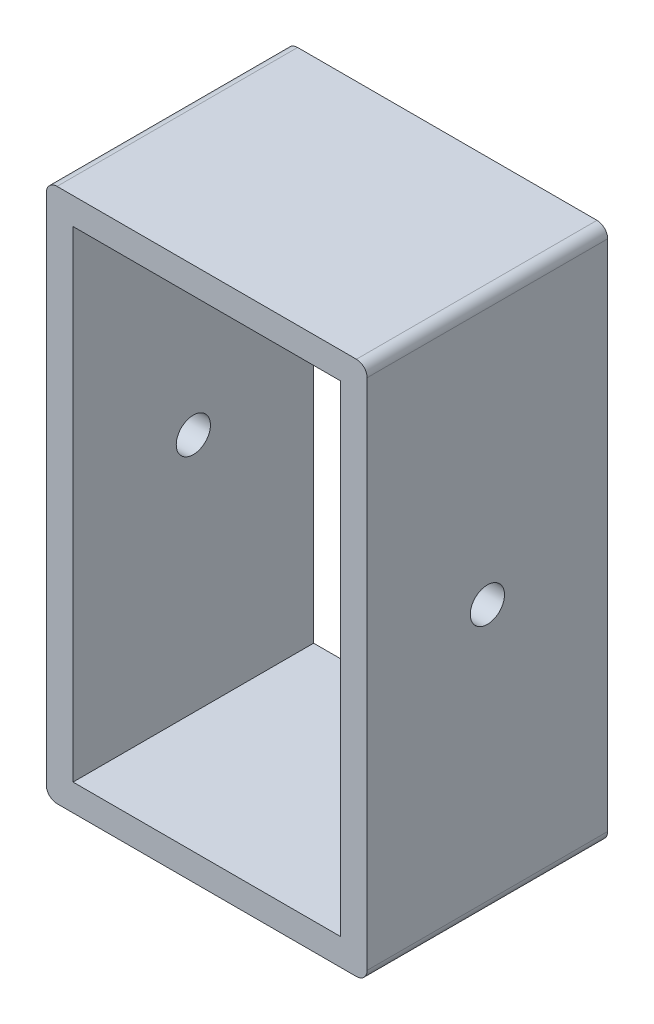
ISO-10303-21;
HEADER;
FILE_DESCRIPTION(('STEP AP214'),'2;1');
FILE_NAME('part.step','',(''),(''),'','','');
FILE_SCHEMA(('AUTOMOTIVE_DESIGN { 1 0 10303 214 1 1 1 1 }'));
ENDSEC;
DATA;
#1=APPLICATION_CONTEXT('core data for automotive mechanical design processes');
#2=APPLICATION_PROTOCOL_DEFINITION('international standard','automotive_design',2000,#1);
#3=PRODUCT_CONTEXT('',#1,'mechanical');
#4=PRODUCT('Part','Part','',(#3));
#5=PRODUCT_RELATED_PRODUCT_CATEGORY('part','',(#4));
#6=PRODUCT_DEFINITION_FORMATION('','',#4);
#7=PRODUCT_DEFINITION_CONTEXT('part definition',#1,'design');
#8=PRODUCT_DEFINITION('design','',#6,#7);
#9=PRODUCT_DEFINITION_SHAPE('','',#8);
#10=(LENGTH_UNIT() NAMED_UNIT(*) SI_UNIT(.MILLI.,.METRE.));
#11=(NAMED_UNIT(*) PLANE_ANGLE_UNIT() SI_UNIT($,.RADIAN.));
#12=(NAMED_UNIT(*) SI_UNIT($,.STERADIAN.) SOLID_ANGLE_UNIT());
#13=UNCERTAINTY_MEASURE_WITH_UNIT(LENGTH_MEASURE(1.E-05),#10,'distance_accuracy_value','');
#14=(GEOMETRIC_REPRESENTATION_CONTEXT(3) GLOBAL_UNCERTAINTY_ASSIGNED_CONTEXT((#13)) GLOBAL_UNIT_ASSIGNED_CONTEXT((#10,
#11,#12)) REPRESENTATION_CONTEXT('',''));
#15=CARTESIAN_POINT('',(0.,0.,0.));
#16=DIRECTION('',(0.,0.,1.));
#17=DIRECTION('',(1.,0.,0.));
#18=AXIS2_PLACEMENT_3D('',#15,#16,#17);
#19=CARTESIAN_POINT('',(2.5,-22.5,-11.25));
#20=DIRECTION('',(0.,0.,1.));
#21=DIRECTION('',(1.,0.,0.));
#22=AXIS2_PLACEMENT_3D('',#19,#20,#21);
#23=PLANE('',#22);
#24=DIRECTION('',(0.,-1.,0.));
#25=VECTOR('',#24,1.);
#26=CARTESIAN_POINT('',(-25.,25.,-11.25));
#27=LINE('',#26,#25);
#28=CARTESIAN_POINT('',(-25.,22.5,-11.25));
#29=VERTEX_POINT('',#28);
#30=CARTESIAN_POINT('',(-25.,-22.5,-11.25));
#31=VERTEX_POINT('',#30);
#32=EDGE_CURVE('E136',#29,#31,#27,.T.);
#33=ORIENTED_EDGE('',*,*,#32,.T.);
#34=DIRECTION('',(1.,0.,0.));
#35=VECTOR('',#34,1.);
#36=CARTESIAN_POINT('',(2.5,-22.5,-11.25));
#37=LINE('',#36,#35);
#38=CARTESIAN_POINT('',(0.,-22.5,-11.25));
#39=VERTEX_POINT('',#38);
#40=EDGE_CURVE('E144',#31,#39,#37,.T.);
#41=ORIENTED_EDGE('',*,*,#40,.T.);
#42=DIRECTION('',(0.,1.,0.));
#43=VECTOR('',#42,1.);
#44=CARTESIAN_POINT('',(0.,-22.5,-11.25));
#45=LINE('',#44,#43);
#46=CARTESIAN_POINT('',(0.,22.5,-11.25));
#47=VERTEX_POINT('',#46);
#48=EDGE_CURVE('E176',#39,#47,#45,.T.);
#49=ORIENTED_EDGE('',*,*,#48,.T.);
#50=DIRECTION('',(-1.,0.,0.));
#51=VECTOR('',#50,1.);
#52=CARTESIAN_POINT('',(2.5,22.5,-11.25));
#53=LINE('',#52,#51);
#54=EDGE_CURVE('E151',#47,#29,#53,.T.);
#55=ORIENTED_EDGE('',*,*,#54,.T.);
#56=EDGE_LOOP('',(#33,#41,#49,#55));
#57=FACE_BOUND('',#56,.T.);
#58=DIRECTION('',(0.,1.,0.));
#59=VECTOR('',#58,1.);
#60=CARTESIAN_POINT('',(2.5,-22.5,-11.25));
#61=LINE('',#60,#59);
#62=CARTESIAN_POINT('',(2.5,-24.,-11.25));
#63=VERTEX_POINT('',#62);
#64=CARTESIAN_POINT('',(2.5,24.,-11.25));
#65=VERTEX_POINT('',#64);
#66=EDGE_CURVE('E169',#63,#65,#61,.T.);
#67=ORIENTED_EDGE('',*,*,#66,.F.);
#68=CARTESIAN_POINT('',(1.5,-24.,-11.25));
#69=DIRECTION('',(0.,0.,1.));
#70=DIRECTION('',(1.,0.,0.));
#71=AXIS2_PLACEMENT_3D('',#68,#69,#70);
#72=CIRCLE('',#71,1.);
#73=CARTESIAN_POINT('',(1.5,-25.,-11.25));
#74=VERTEX_POINT('',#73);
#75=EDGE_CURVE('E48',#63,#74,#72,.F.);
#76=ORIENTED_EDGE('',*,*,#75,.T.);
#77=DIRECTION('',(1.,0.,0.));
#78=VECTOR('',#77,1.);
#79=CARTESIAN_POINT('',(2.5,-25.,-11.25));
#80=LINE('',#79,#78);
#81=CARTESIAN_POINT('',(-26.5,-25.,-11.25));
#82=VERTEX_POINT('',#81);
#83=EDGE_CURVE('E165',#82,#74,#80,.T.);
#84=ORIENTED_EDGE('',*,*,#83,.F.);
#85=CARTESIAN_POINT('',(-26.5,-24.,-11.25));
#86=DIRECTION('',(0.,0.,1.));
#87=DIRECTION('',(1.,0.,0.));
#88=AXIS2_PLACEMENT_3D('',#85,#86,#87);
#89=CIRCLE('',#88,1.);
#90=CARTESIAN_POINT('',(-27.5,-24.,-11.25));
#91=VERTEX_POINT('',#90);
#92=EDGE_CURVE('E55',#82,#91,#89,.F.);
#93=ORIENTED_EDGE('',*,*,#92,.T.);
#94=DIRECTION('',(0.,-1.,0.));
#95=VECTOR('',#94,1.);
#96=CARTESIAN_POINT('',(-27.5,25.,-11.25));
#97=LINE('',#96,#95);
#98=CARTESIAN_POINT('',(-27.5,24.,-11.25));
#99=VERTEX_POINT('',#98);
#100=EDGE_CURVE('E318',#99,#91,#97,.T.);
#101=ORIENTED_EDGE('',*,*,#100,.F.);
#102=CARTESIAN_POINT('',(-26.5,24.,-11.25));
#103=DIRECTION('',(0.,0.,1.));
#104=DIRECTION('',(1.,0.,0.));
#105=AXIS2_PLACEMENT_3D('',#102,#103,#104);
#106=CIRCLE('',#105,1.);
#107=CARTESIAN_POINT('',(-26.5,25.,-11.25));
#108=VERTEX_POINT('',#107);
#109=EDGE_CURVE('E195',#99,#108,#106,.F.);
#110=ORIENTED_EDGE('',*,*,#109,.T.);
#111=DIRECTION('',(-1.,0.,0.));
#112=VECTOR('',#111,1.);
#113=CARTESIAN_POINT('',(2.5,25.,-11.25));
#114=LINE('',#113,#112);
#115=CARTESIAN_POINT('',(1.5,25.,-11.25));
#116=VERTEX_POINT('',#115);
#117=EDGE_CURVE('E262',#116,#108,#114,.T.);
#118=ORIENTED_EDGE('',*,*,#117,.F.);
#119=CARTESIAN_POINT('',(1.5,24.,-11.25));
#120=DIRECTION('',(0.,0.,1.));
#121=DIRECTION('',(1.,0.,0.));
#122=AXIS2_PLACEMENT_3D('',#119,#120,#121);
#123=CIRCLE('',#122,1.);
#124=EDGE_CURVE('E191',#116,#65,#123,.F.);
#125=ORIENTED_EDGE('',*,*,#124,.T.);
#126=EDGE_LOOP('',(#67,#76,#84,#93,#101,#110,#118,#125));
#127=FACE_BOUND('',#126,.T.);
#128=ADVANCED_FACE('F39',(#57,#127),#23,.F.);
#129=CARTESIAN_POINT('',(2.5,-22.5,11.25));
#130=DIRECTION('',(0.,0.,-1.));
#131=DIRECTION('',(-1.,0.,0.));
#132=AXIS2_PLACEMENT_3D('',#129,#130,#131);
#133=PLANE('',#132);
#134=DIRECTION('',(-1.,0.,0.));
#135=VECTOR('',#134,1.);
#136=CARTESIAN_POINT('',(2.5,-22.5,11.25));
#137=LINE('',#136,#135);
#138=CARTESIAN_POINT('',(0.,-22.5,11.25));
#139=VERTEX_POINT('',#138);
#140=CARTESIAN_POINT('',(-25.,-22.5,11.25));
#141=VERTEX_POINT('',#140);
#142=EDGE_CURVE('E145',#139,#141,#137,.T.);
#143=ORIENTED_EDGE('',*,*,#142,.T.);
#144=DIRECTION('',(0.,1.,0.));
#145=VECTOR('',#144,1.);
#146=CARTESIAN_POINT('',(-25.,25.,11.25));
#147=LINE('',#146,#145);
#148=CARTESIAN_POINT('',(-25.,22.5,11.25));
#149=VERTEX_POINT('',#148);
#150=EDGE_CURVE('E138',#141,#149,#147,.T.);
#151=ORIENTED_EDGE('',*,*,#150,.T.);
#152=DIRECTION('',(1.,0.,0.));
#153=VECTOR('',#152,1.);
#154=CARTESIAN_POINT('',(2.5,22.5,11.25));
#155=LINE('',#154,#153);
#156=CARTESIAN_POINT('',(0.,22.5,11.25));
#157=VERTEX_POINT('',#156);
#158=EDGE_CURVE('E266',#149,#157,#155,.T.);
#159=ORIENTED_EDGE('',*,*,#158,.T.);
#160=DIRECTION('',(0.,-1.,0.));
#161=VECTOR('',#160,1.);
#162=CARTESIAN_POINT('',(0.,-22.5,11.25));
#163=LINE('',#162,#161);
#164=EDGE_CURVE('E183',#157,#139,#163,.T.);
#165=ORIENTED_EDGE('',*,*,#164,.T.);
#166=EDGE_LOOP('',(#143,#151,#159,#165));
#167=FACE_BOUND('',#166,.T.);
#168=DIRECTION('',(-1.,0.,0.));
#169=VECTOR('',#168,1.);
#170=CARTESIAN_POINT('',(2.5,-25.,11.25));
#171=LINE('',#170,#169);
#172=CARTESIAN_POINT('',(1.5,-25.,11.25));
#173=VERTEX_POINT('',#172);
#174=CARTESIAN_POINT('',(-26.5,-25.,11.25));
#175=VERTEX_POINT('',#174);
#176=EDGE_CURVE('E161',#173,#175,#171,.T.);
#177=ORIENTED_EDGE('',*,*,#176,.F.);
#178=CARTESIAN_POINT('',(1.5,-24.,11.25));
#179=DIRECTION('',(0.,0.,-1.));
#180=DIRECTION('',(-1.,0.,0.));
#181=AXIS2_PLACEMENT_3D('',#178,#179,#180);
#182=CIRCLE('',#181,1.);
#183=CARTESIAN_POINT('',(2.5,-24.,11.25));
#184=VERTEX_POINT('',#183);
#185=EDGE_CURVE('E225',#173,#184,#182,.F.);
#186=ORIENTED_EDGE('',*,*,#185,.T.);
#187=DIRECTION('',(0.,-1.,0.));
#188=VECTOR('',#187,1.);
#189=CARTESIAN_POINT('',(2.5,-22.5,11.25));
#190=LINE('',#189,#188);
#191=CARTESIAN_POINT('',(2.5,24.,11.25));
#192=VERTEX_POINT('',#191);
#193=EDGE_CURVE('E172',#192,#184,#190,.T.);
#194=ORIENTED_EDGE('',*,*,#193,.F.);
#195=CARTESIAN_POINT('',(1.5,24.,11.25));
#196=DIRECTION('',(0.,0.,-1.));
#197=DIRECTION('',(-1.,0.,0.));
#198=AXIS2_PLACEMENT_3D('',#195,#196,#197);
#199=CIRCLE('',#198,1.);
#200=CARTESIAN_POINT('',(1.5,25.,11.25));
#201=VERTEX_POINT('',#200);
#202=EDGE_CURVE('E205',#192,#201,#199,.F.);
#203=ORIENTED_EDGE('',*,*,#202,.T.);
#204=DIRECTION('',(1.,0.,0.));
#205=VECTOR('',#204,1.);
#206=CARTESIAN_POINT('',(2.5,25.,11.25));
#207=LINE('',#206,#205);
#208=CARTESIAN_POINT('',(-26.5,25.,11.25));
#209=VERTEX_POINT('',#208);
#210=EDGE_CURVE('E254',#209,#201,#207,.T.);
#211=ORIENTED_EDGE('',*,*,#210,.F.);
#212=CARTESIAN_POINT('',(-26.5,24.,11.25));
#213=DIRECTION('',(0.,0.,-1.));
#214=DIRECTION('',(-1.,0.,0.));
#215=AXIS2_PLACEMENT_3D('',#212,#213,#214);
#216=CIRCLE('',#215,1.);
#217=CARTESIAN_POINT('',(-27.5,24.,11.25));
#218=VERTEX_POINT('',#217);
#219=EDGE_CURVE('E208',#209,#218,#216,.F.);
#220=ORIENTED_EDGE('',*,*,#219,.T.);
#221=DIRECTION('',(0.,1.,0.));
#222=VECTOR('',#221,1.);
#223=CARTESIAN_POINT('',(-27.5,25.,11.25));
#224=LINE('',#223,#222);
#225=CARTESIAN_POINT('',(-27.5,-24.,11.25));
#226=VERTEX_POINT('',#225);
#227=EDGE_CURVE('E273',#226,#218,#224,.T.);
#228=ORIENTED_EDGE('',*,*,#227,.F.);
#229=CARTESIAN_POINT('',(-26.5,-24.,11.25));
#230=DIRECTION('',(0.,0.,-1.));
#231=DIRECTION('',(-1.,0.,0.));
#232=AXIS2_PLACEMENT_3D('',#229,#230,#231);
#233=CIRCLE('',#232,1.);
#234=EDGE_CURVE('E222',#226,#175,#233,.F.);
#235=ORIENTED_EDGE('',*,*,#234,.T.);
#236=EDGE_LOOP('',(#177,#186,#194,#203,#211,#220,#228,#235));
#237=FACE_BOUND('',#236,.T.);
#238=ADVANCED_FACE('F245',(#167,#237),#133,.F.);
#239=CARTESIAN_POINT('',(2.5,0.,0.));
#240=DIRECTION('',(-1.,0.,0.));
#241=DIRECTION('',(0.,0.,1.));
#242=AXIS2_PLACEMENT_3D('',#239,#240,#241);
#243=PLANE('',#242);
#244=CARTESIAN_POINT('',(2.5,0.,0.));
#245=DIRECTION('',(-1.,0.,0.));
#246=DIRECTION('',(0.,0.,1.));
#247=AXIS2_PLACEMENT_3D('',#244,#245,#246);
#248=CIRCLE('',#247,1.6);
#249=CARTESIAN_POINT('',(2.5,0.,1.6));
#250=VERTEX_POINT('',#249);
#251=EDGE_CURVE('E332',#250,#250,#248,.T.);
#252=ORIENTED_EDGE('',*,*,#251,.T.);
#253=EDGE_LOOP('',(#252));
#254=FACE_BOUND('',#253,.T.);
#255=ORIENTED_EDGE('',*,*,#193,.T.);
#256=DIRECTION('',(0.,0.,1.));
#257=VECTOR('',#256,1.);
#258=CARTESIAN_POINT('',(2.5,-24.,-11.25));
#259=LINE('',#258,#257);
#260=EDGE_CURVE('E63',#184,#63,#259,.F.);
#261=ORIENTED_EDGE('',*,*,#260,.T.);
#262=ORIENTED_EDGE('',*,*,#66,.T.);
#263=DIRECTION('',(0.,0.,-1.));
#264=VECTOR('',#263,1.);
#265=CARTESIAN_POINT('',(2.5,24.,0.));
#266=LINE('',#265,#264);
#267=EDGE_CURVE('E212',#65,#192,#266,.F.);
#268=ORIENTED_EDGE('',*,*,#267,.T.);
#269=EDGE_LOOP('',(#255,#261,#262,#268));
#270=FACE_BOUND('',#269,.T.);
#271=ADVANCED_FACE('F247',(#254,#270),#243,.F.);
#272=CARTESIAN_POINT('',(0.,0.,0.));
#273=DIRECTION('',(-1.,0.,0.));
#274=DIRECTION('',(0.,0.,1.));
#275=AXIS2_PLACEMENT_3D('',#272,#273,#274);
#276=PLANE('',#275);
#277=CARTESIAN_POINT('',(0.,0.,0.));
#278=DIRECTION('',(-1.,0.,0.));
#279=DIRECTION('',(0.,0.,1.));
#280=AXIS2_PLACEMENT_3D('',#277,#278,#279);
#281=CIRCLE('',#280,1.6);
#282=CARTESIAN_POINT('',(0.,0.,1.6));
#283=VERTEX_POINT('',#282);
#284=EDGE_CURVE('E154',#283,#283,#281,.T.);
#285=ORIENTED_EDGE('',*,*,#284,.F.);
#286=EDGE_LOOP('',(#285));
#287=FACE_BOUND('',#286,.T.);
#288=ORIENTED_EDGE('',*,*,#48,.F.);
#289=DIRECTION('',(0.,0.,-1.));
#290=VECTOR('',#289,1.);
#291=CARTESIAN_POINT('',(0.,-22.5,11.25));
#292=LINE('',#291,#290);
#293=EDGE_CURVE('E159',#139,#39,#292,.T.);
#294=ORIENTED_EDGE('',*,*,#293,.F.);
#295=ORIENTED_EDGE('',*,*,#164,.F.);
#296=DIRECTION('',(0.,0.,1.));
#297=VECTOR('',#296,1.);
#298=CARTESIAN_POINT('',(0.,22.5,11.25));
#299=LINE('',#298,#297);
#300=EDGE_CURVE('E179',#47,#157,#299,.T.);
#301=ORIENTED_EDGE('',*,*,#300,.F.);
#302=EDGE_LOOP('',(#288,#294,#295,#301));
#303=FACE_BOUND('',#302,.T.);
#304=ADVANCED_FACE('F282',(#287,#303),#276,.T.);
#305=CARTESIAN_POINT('',(0.,-22.5,0.));
#306=DIRECTION('',(0.,-1.,0.));
#307=DIRECTION('',(0.,0.,-1.));
#308=AXIS2_PLACEMENT_3D('',#305,#306,#307);
#309=PLANE('',#308);
#310=ORIENTED_EDGE('',*,*,#142,.F.);
#311=ORIENTED_EDGE('',*,*,#293,.T.);
#312=ORIENTED_EDGE('',*,*,#40,.F.);
#313=DIRECTION('',(0.,0.,-1.));
#314=VECTOR('',#313,1.);
#315=CARTESIAN_POINT('',(-25.,-22.5,-11.25));
#316=LINE('',#315,#314);
#317=EDGE_CURVE('E132',#141,#31,#316,.T.);
#318=ORIENTED_EDGE('',*,*,#317,.F.);
#319=EDGE_LOOP('',(#310,#311,#312,#318));
#320=FACE_BOUND('',#319,.T.);
#321=ADVANCED_FACE('F157',(#320),#309,.F.);
#322=CARTESIAN_POINT('',(0.,-25.,0.));
#323=DIRECTION('',(0.,-1.,0.));
#324=DIRECTION('',(0.,0.,-1.));
#325=AXIS2_PLACEMENT_3D('',#322,#323,#324);
#326=PLANE('',#325);
#327=ORIENTED_EDGE('',*,*,#83,.T.);
#328=DIRECTION('',(0.,0.,1.));
#329=VECTOR('',#328,1.);
#330=CARTESIAN_POINT('',(1.5,-25.,11.25));
#331=LINE('',#330,#329);
#332=EDGE_CURVE('E218',#74,#173,#331,.T.);
#333=ORIENTED_EDGE('',*,*,#332,.T.);
#334=ORIENTED_EDGE('',*,*,#176,.T.);
#335=DIRECTION('',(0.,0.,1.));
#336=VECTOR('',#335,1.);
#337=CARTESIAN_POINT('',(-26.5,-25.,0.));
#338=LINE('',#337,#336);
#339=EDGE_CURVE('E215',#175,#82,#338,.F.);
#340=ORIENTED_EDGE('',*,*,#339,.T.);
#341=EDGE_LOOP('',(#327,#333,#334,#340));
#342=FACE_BOUND('',#341,.T.);
#343=ADVANCED_FACE('F237',(#342),#326,.T.);
#344=CARTESIAN_POINT('',(0.,25.,0.));
#345=DIRECTION('',(0.,-1.,0.));
#346=DIRECTION('',(0.,0.,-1.));
#347=AXIS2_PLACEMENT_3D('',#344,#345,#346);
#348=PLANE('',#347);
#349=ORIENTED_EDGE('',*,*,#117,.T.);
#350=DIRECTION('',(0.,0.,-1.));
#351=VECTOR('',#350,1.);
#352=CARTESIAN_POINT('',(-26.5,25.,11.25));
#353=LINE('',#352,#351);
#354=EDGE_CURVE('E202',#108,#209,#353,.F.);
#355=ORIENTED_EDGE('',*,*,#354,.T.);
#356=ORIENTED_EDGE('',*,*,#210,.T.);
#357=DIRECTION('',(0.,0.,-1.));
#358=VECTOR('',#357,1.);
#359=CARTESIAN_POINT('',(1.5,25.,0.));
#360=LINE('',#359,#358);
#361=EDGE_CURVE('E198',#201,#116,#360,.T.);
#362=ORIENTED_EDGE('',*,*,#361,.T.);
#363=EDGE_LOOP('',(#349,#355,#356,#362));
#364=FACE_BOUND('',#363,.T.);
#365=ADVANCED_FACE('F258',(#364),#348,.F.);
#366=CARTESIAN_POINT('',(0.,22.5,0.));
#367=DIRECTION('',(0.,-1.,0.));
#368=DIRECTION('',(0.,0.,-1.));
#369=AXIS2_PLACEMENT_3D('',#366,#367,#368);
#370=PLANE('',#369);
#371=ORIENTED_EDGE('',*,*,#54,.F.);
#372=ORIENTED_EDGE('',*,*,#300,.T.);
#373=ORIENTED_EDGE('',*,*,#158,.F.);
#374=DIRECTION('',(0.,0.,1.));
#375=VECTOR('',#374,1.);
#376=CARTESIAN_POINT('',(-25.,22.5,-11.25));
#377=LINE('',#376,#375);
#378=EDGE_CURVE('E272',#29,#149,#377,.T.);
#379=ORIENTED_EDGE('',*,*,#378,.F.);
#380=EDGE_LOOP('',(#371,#372,#373,#379));
#381=FACE_BOUND('',#380,.T.);
#382=ADVANCED_FACE('F280',(#381),#370,.T.);
#383=CARTESIAN_POINT('',(-25.,0.,0.));
#384=DIRECTION('',(-1.,0.,0.));
#385=DIRECTION('',(0.,0.,1.));
#386=AXIS2_PLACEMENT_3D('',#383,#384,#385);
#387=PLANE('',#386);
#388=CARTESIAN_POINT('',(-25.,0.,0.));
#389=DIRECTION('',(-1.,0.,0.));
#390=DIRECTION('',(0.,0.,1.));
#391=AXIS2_PLACEMENT_3D('',#388,#389,#390);
#392=CIRCLE('',#391,1.6);
#393=CARTESIAN_POINT('',(-25.,0.,1.6));
#394=VERTEX_POINT('',#393);
#395=EDGE_CURVE('E329',#394,#394,#392,.T.);
#396=ORIENTED_EDGE('',*,*,#395,.T.);
#397=EDGE_LOOP('',(#396));
#398=FACE_BOUND('',#397,.T.);
#399=ORIENTED_EDGE('',*,*,#150,.F.);
#400=ORIENTED_EDGE('',*,*,#317,.T.);
#401=ORIENTED_EDGE('',*,*,#32,.F.);
#402=ORIENTED_EDGE('',*,*,#378,.T.);
#403=EDGE_LOOP('',(#399,#400,#401,#402));
#404=FACE_BOUND('',#403,.T.);
#405=ADVANCED_FACE('F134',(#398,#404),#387,.F.);
#406=CARTESIAN_POINT('',(-27.5,0.,0.));
#407=DIRECTION('',(-1.,0.,0.));
#408=DIRECTION('',(0.,0.,1.));
#409=AXIS2_PLACEMENT_3D('',#406,#407,#408);
#410=PLANE('',#409);
#411=CARTESIAN_POINT('',(-27.5,0.,0.));
#412=DIRECTION('',(-1.,0.,0.));
#413=DIRECTION('',(0.,0.,1.));
#414=AXIS2_PLACEMENT_3D('',#411,#412,#413);
#415=CIRCLE('',#414,1.6);
#416=CARTESIAN_POINT('',(-27.5,0.,1.6));
#417=VERTEX_POINT('',#416);
#418=EDGE_CURVE('E336',#417,#417,#415,.T.);
#419=ORIENTED_EDGE('',*,*,#418,.F.);
#420=EDGE_LOOP('',(#419));
#421=FACE_BOUND('',#420,.T.);
#422=ORIENTED_EDGE('',*,*,#100,.T.);
#423=DIRECTION('',(0.,0.,1.));
#424=VECTOR('',#423,1.);
#425=CARTESIAN_POINT('',(-27.5,-24.,0.));
#426=LINE('',#425,#424);
#427=EDGE_CURVE('E11',#91,#226,#426,.T.);
#428=ORIENTED_EDGE('',*,*,#427,.T.);
#429=ORIENTED_EDGE('',*,*,#227,.T.);
#430=DIRECTION('',(0.,0.,-1.));
#431=VECTOR('',#430,1.);
#432=CARTESIAN_POINT('',(-27.5,24.,-11.25));
#433=LINE('',#432,#431);
#434=EDGE_CURVE('E175',#218,#99,#433,.T.);
#435=ORIENTED_EDGE('',*,*,#434,.T.);
#436=EDGE_LOOP('',(#422,#428,#429,#435));
#437=FACE_BOUND('',#436,.T.);
#438=ADVANCED_FACE('F317',(#421,#437),#410,.T.);
#439=CARTESIAN_POINT('',(2.5,0.,0.));
#440=DIRECTION('',(-1.,0.,0.));
#441=DIRECTION('',(0.,0.,1.));
#442=AXIS2_PLACEMENT_3D('',#439,#440,#441);
#443=CYLINDRICAL_SURFACE('',#442,1.6);
#444=ORIENTED_EDGE('',*,*,#418,.T.);
#445=EDGE_LOOP('',(#444));
#446=FACE_BOUND('',#445,.T.);
#447=ORIENTED_EDGE('',*,*,#395,.F.);
#448=EDGE_LOOP('',(#447));
#449=FACE_BOUND('',#448,.T.);
#450=ADVANCED_FACE('F342',(#446,#449),#443,.F.);
#451=ORIENTED_EDGE('',*,*,#284,.T.);
#452=EDGE_LOOP('',(#451));
#453=FACE_BOUND('',#452,.T.);
#454=ORIENTED_EDGE('',*,*,#251,.F.);
#455=EDGE_LOOP('',(#454));
#456=FACE_BOUND('',#455,.T.);
#457=ADVANCED_FACE('F304',(#453,#456),#443,.F.);
#458=CARTESIAN_POINT('',(-26.5,24.,0.));
#459=DIRECTION('',(0.,0.,1.));
#460=DIRECTION('',(1.,0.,0.));
#461=AXIS2_PLACEMENT_3D('',#458,#459,#460);
#462=CYLINDRICAL_SURFACE('',#461,1.);
#463=ORIENTED_EDGE('',*,*,#219,.F.);
#464=ORIENTED_EDGE('',*,*,#354,.F.);
#465=ORIENTED_EDGE('',*,*,#109,.F.);
#466=ORIENTED_EDGE('',*,*,#434,.F.);
#467=EDGE_LOOP('',(#463,#464,#465,#466));
#468=FACE_BOUND('',#467,.T.);
#469=ADVANCED_FACE('F301',(#468),#462,.T.);
#470=CARTESIAN_POINT('',(1.5,24.,0.));
#471=DIRECTION('',(0.,0.,-1.));
#472=DIRECTION('',(-1.,0.,0.));
#473=AXIS2_PLACEMENT_3D('',#470,#471,#472);
#474=CYLINDRICAL_SURFACE('',#473,1.);
#475=ORIENTED_EDGE('',*,*,#202,.F.);
#476=ORIENTED_EDGE('',*,*,#267,.F.);
#477=ORIENTED_EDGE('',*,*,#124,.F.);
#478=ORIENTED_EDGE('',*,*,#361,.F.);
#479=EDGE_LOOP('',(#475,#476,#477,#478));
#480=FACE_BOUND('',#479,.T.);
#481=ADVANCED_FACE('F250',(#480),#474,.T.);
#482=CARTESIAN_POINT('',(1.5,-24.,0.));
#483=DIRECTION('',(0.,0.,-1.));
#484=DIRECTION('',(-1.,0.,0.));
#485=AXIS2_PLACEMENT_3D('',#482,#483,#484);
#486=CYLINDRICAL_SURFACE('',#485,1.);
#487=ORIENTED_EDGE('',*,*,#75,.F.);
#488=ORIENTED_EDGE('',*,*,#260,.F.);
#489=ORIENTED_EDGE('',*,*,#185,.F.);
#490=ORIENTED_EDGE('',*,*,#332,.F.);
#491=EDGE_LOOP('',(#487,#488,#489,#490));
#492=FACE_BOUND('',#491,.T.);
#493=ADVANCED_FACE('F242',(#492),#486,.T.);
#494=CARTESIAN_POINT('',(-26.5,-24.,0.));
#495=DIRECTION('',(0.,0.,1.));
#496=DIRECTION('',(1.,0.,0.));
#497=AXIS2_PLACEMENT_3D('',#494,#495,#496);
#498=CYLINDRICAL_SURFACE('',#497,1.);
#499=ORIENTED_EDGE('',*,*,#92,.F.);
#500=ORIENTED_EDGE('',*,*,#339,.F.);
#501=ORIENTED_EDGE('',*,*,#234,.F.);
#502=ORIENTED_EDGE('',*,*,#427,.F.);
#503=EDGE_LOOP('',(#499,#500,#501,#502));
#504=FACE_BOUND('',#503,.T.);
#505=ADVANCED_FACE('F41',(#504),#498,.T.);
#506=CLOSED_SHELL('',(#128,#238,#271,#304,#321,#343,#365,#382,#405,#438,#450,#457,#469,#481,
#493,#505));
#507=MANIFOLD_SOLID_BREP('B2',#506);
#508=ADVANCED_BREP_SHAPE_REPRESENTATION('',(#18,#507),#14);
#509=SHAPE_DEFINITION_REPRESENTATION(#9,#508);
ENDSEC;
END-ISO-10303-21;
